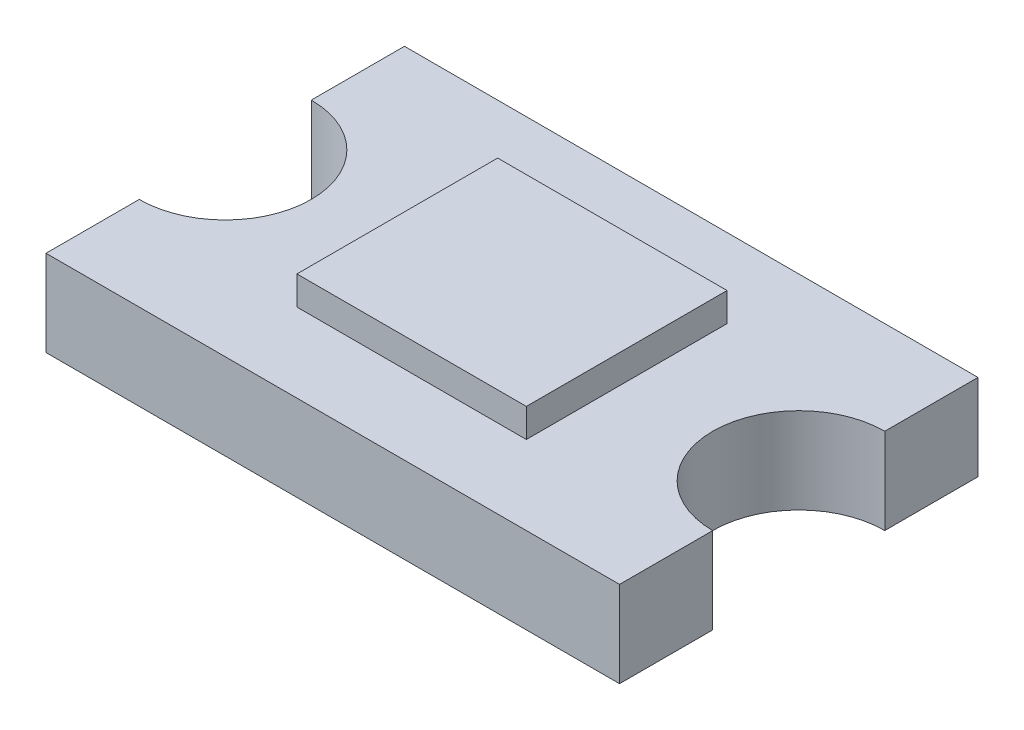
ISO-10303-21;
HEADER;
FILE_DESCRIPTION(('STEP AP214'),'2;1');
FILE_NAME('part.step','',(''),(''),'','','');
FILE_SCHEMA(('AUTOMOTIVE_DESIGN { 1 0 10303 214 1 1 1 1 }'));
ENDSEC;
DATA;
#1=APPLICATION_CONTEXT('core data for automotive mechanical design processes');
#2=APPLICATION_PROTOCOL_DEFINITION('international standard','automotive_design',2000,#1);
#3=PRODUCT_CONTEXT('',#1,'mechanical');
#4=PRODUCT('Part','Part','',(#3));
#5=PRODUCT_RELATED_PRODUCT_CATEGORY('part','',(#4));
#6=PRODUCT_DEFINITION_FORMATION('','',#4);
#7=PRODUCT_DEFINITION_CONTEXT('part definition',#1,'design');
#8=PRODUCT_DEFINITION('design','',#6,#7);
#9=PRODUCT_DEFINITION_SHAPE('','',#8);
#10=(LENGTH_UNIT() NAMED_UNIT(*) SI_UNIT(.MILLI.,.METRE.));
#11=(NAMED_UNIT(*) PLANE_ANGLE_UNIT() SI_UNIT($,.RADIAN.));
#12=(NAMED_UNIT(*) SI_UNIT($,.STERADIAN.) SOLID_ANGLE_UNIT());
#13=UNCERTAINTY_MEASURE_WITH_UNIT(LENGTH_MEASURE(1.E-05),#10,'distance_accuracy_value','');
#14=(GEOMETRIC_REPRESENTATION_CONTEXT(3) GLOBAL_UNCERTAINTY_ASSIGNED_CONTEXT((#13)) GLOBAL_UNIT_ASSIGNED_CONTEXT((#10,
#11,#12)) REPRESENTATION_CONTEXT('',''));
#15=CARTESIAN_POINT('',(0.,0.,0.));
#16=DIRECTION('',(0.,0.,1.));
#17=DIRECTION('',(1.,0.,0.));
#18=AXIS2_PLACEMENT_3D('',#15,#16,#17);
#19=CARTESIAN_POINT('',(1.,0.3,0.));
#20=DIRECTION('',(0.,-1.,0.));
#21=DIRECTION('',(0.,0.,-1.));
#22=AXIS2_PLACEMENT_3D('',#19,#20,#21);
#23=CYLINDRICAL_SURFACE('',#22,0.3);
#24=CARTESIAN_POINT('',(1.,0.,0.));
#25=DIRECTION('',(0.,-1.,0.));
#26=DIRECTION('',(0.,0.,1.));
#27=AXIS2_PLACEMENT_3D('',#24,#25,#26);
#28=CIRCLE('',#27,0.3);
#29=CARTESIAN_POINT('',(1.,0.,0.3));
#30=VERTEX_POINT('',#29);
#31=CARTESIAN_POINT('',(1.,0.,-0.3));
#32=VERTEX_POINT('',#31);
#33=EDGE_CURVE('P0_E150',#30,#32,#28,.T.);
#34=ORIENTED_EDGE('',*,*,#33,.T.);
#35=DIRECTION('',(0.,-1.,0.));
#36=VECTOR('',#35,1.);
#37=CARTESIAN_POINT('',(1.,0.3,-0.3));
#38=LINE('',#37,#36);
#39=CARTESIAN_POINT('',(1.,0.3,-0.3));
#40=VERTEX_POINT('',#39);
#41=EDGE_CURVE('P0_E146',#40,#32,#38,.T.);
#42=ORIENTED_EDGE('',*,*,#41,.F.);
#43=CARTESIAN_POINT('',(1.,0.3,0.));
#44=DIRECTION('',(0.,-1.,0.));
#45=DIRECTION('',(0.,0.,1.));
#46=AXIS2_PLACEMENT_3D('',#43,#44,#45);
#47=CIRCLE('',#46,0.3);
#48=CARTESIAN_POINT('',(1.,0.3,0.3));
#49=VERTEX_POINT('',#48);
#50=EDGE_CURVE('P0_E11',#49,#40,#47,.T.);
#51=ORIENTED_EDGE('',*,*,#50,.F.);
#52=DIRECTION('',(0.,-1.,0.));
#53=VECTOR('',#52,1.);
#54=CARTESIAN_POINT('',(1.,0.3,0.3));
#55=LINE('',#54,#53);
#56=EDGE_CURVE('P0_E25',#49,#30,#55,.T.);
#57=ORIENTED_EDGE('',*,*,#56,.T.);
#58=EDGE_LOOP('',(#34,#42,#51,#57));
#59=FACE_BOUND('',#58,.T.);
#60=ADVANCED_FACE('P0_F17',(#59),#23,.F.);
#61=CARTESIAN_POINT('',(-1.,0.3,0.625));
#62=DIRECTION('',(0.,0.,-1.));
#63=DIRECTION('',(0.,-1.,0.));
#64=AXIS2_PLACEMENT_3D('',#61,#62,#63);
#65=PLANE('',#64);
#66=DIRECTION('',(1.,0.,0.));
#67=VECTOR('',#66,1.);
#68=CARTESIAN_POINT('',(-1.,0.,0.625));
#69=LINE('',#68,#67);
#70=CARTESIAN_POINT('',(-1.,0.,0.625));
#71=VERTEX_POINT('',#70);
#72=CARTESIAN_POINT('',(1.,0.,0.625));
#73=VERTEX_POINT('',#72);
#74=EDGE_CURVE('P0_E174',#71,#73,#69,.T.);
#75=ORIENTED_EDGE('',*,*,#74,.T.);
#76=DIRECTION('',(0.,-1.,0.));
#77=VECTOR('',#76,1.);
#78=CARTESIAN_POINT('',(1.,0.3,0.625));
#79=LINE('',#78,#77);
#80=CARTESIAN_POINT('',(1.,0.3,0.625));
#81=VERTEX_POINT('',#80);
#82=EDGE_CURVE('P0_E142',#81,#73,#79,.T.);
#83=ORIENTED_EDGE('',*,*,#82,.F.);
#84=DIRECTION('',(1.,0.,0.));
#85=VECTOR('',#84,1.);
#86=CARTESIAN_POINT('',(-1.,0.3,0.625));
#87=LINE('',#86,#85);
#88=CARTESIAN_POINT('',(-1.,0.3,0.625));
#89=VERTEX_POINT('',#88);
#90=EDGE_CURVE('P0_E165',#89,#81,#87,.T.);
#91=ORIENTED_EDGE('',*,*,#90,.F.);
#92=DIRECTION('',(0.,-1.,0.));
#93=VECTOR('',#92,1.);
#94=CARTESIAN_POINT('',(-1.,0.3,0.625));
#95=LINE('',#94,#93);
#96=EDGE_CURVE('P0_E138',#89,#71,#95,.T.);
#97=ORIENTED_EDGE('',*,*,#96,.T.);
#98=EDGE_LOOP('',(#75,#83,#91,#97));
#99=FACE_BOUND('',#98,.T.);
#100=ADVANCED_FACE('P0_F388',(#99),#65,.F.);
#101=CARTESIAN_POINT('',(-1.,0.3,0.));
#102=DIRECTION('',(0.,-1.,0.));
#103=DIRECTION('',(0.,0.,-1.));
#104=AXIS2_PLACEMENT_3D('',#101,#102,#103);
#105=CYLINDRICAL_SURFACE('',#104,0.3);
#106=CARTESIAN_POINT('',(-1.,0.,0.));
#107=DIRECTION('',(0.,-1.,0.));
#108=DIRECTION('',(0.,0.,1.));
#109=AXIS2_PLACEMENT_3D('',#106,#107,#108);
#110=CIRCLE('',#109,0.3);
#111=CARTESIAN_POINT('',(-1.,0.,-0.3));
#112=VERTEX_POINT('',#111);
#113=CARTESIAN_POINT('',(-1.,0.,0.3));
#114=VERTEX_POINT('',#113);
#115=EDGE_CURVE('P0_E101',#112,#114,#110,.T.);
#116=ORIENTED_EDGE('',*,*,#115,.T.);
#117=DIRECTION('',(0.,-1.,0.));
#118=VECTOR('',#117,1.);
#119=CARTESIAN_POINT('',(-1.,0.3,0.3));
#120=LINE('',#119,#118);
#121=CARTESIAN_POINT('',(-1.,0.3,0.3));
#122=VERTEX_POINT('',#121);
#123=EDGE_CURVE('P0_E111',#122,#114,#120,.T.);
#124=ORIENTED_EDGE('',*,*,#123,.F.);
#125=CARTESIAN_POINT('',(-1.,0.3,0.));
#126=DIRECTION('',(0.,-1.,0.));
#127=DIRECTION('',(0.,0.,1.));
#128=AXIS2_PLACEMENT_3D('',#125,#126,#127);
#129=CIRCLE('',#128,0.3);
#130=CARTESIAN_POINT('',(-1.,0.3,-0.3));
#131=VERTEX_POINT('',#130);
#132=EDGE_CURVE('P0_E118',#131,#122,#129,.T.);
#133=ORIENTED_EDGE('',*,*,#132,.F.);
#134=DIRECTION('',(0.,-1.,0.));
#135=VECTOR('',#134,1.);
#136=CARTESIAN_POINT('',(-1.,0.3,-0.3));
#137=LINE('',#136,#135);
#138=EDGE_CURVE('P0_E115',#131,#112,#137,.T.);
#139=ORIENTED_EDGE('',*,*,#138,.T.);
#140=EDGE_LOOP('',(#116,#124,#133,#139));
#141=FACE_BOUND('',#140,.T.);
#142=ADVANCED_FACE('P0_F116',(#141),#105,.F.);
#143=CARTESIAN_POINT('',(-1.,0.3,-0.625));
#144=DIRECTION('',(0.,0.,1.));
#145=DIRECTION('',(1.,0.,0.));
#146=AXIS2_PLACEMENT_3D('',#143,#144,#145);
#147=PLANE('',#146);
#148=DIRECTION('',(-1.,0.,0.));
#149=VECTOR('',#148,1.);
#150=CARTESIAN_POINT('',(-1.,0.,-0.625));
#151=LINE('',#150,#149);
#152=CARTESIAN_POINT('',(1.,0.,-0.625));
#153=VERTEX_POINT('',#152);
#154=CARTESIAN_POINT('',(-1.,0.,-0.625));
#155=VERTEX_POINT('',#154);
#156=EDGE_CURVE('P0_E153',#153,#155,#151,.T.);
#157=ORIENTED_EDGE('',*,*,#156,.T.);
#158=DIRECTION('',(0.,-1.,0.));
#159=VECTOR('',#158,1.);
#160=CARTESIAN_POINT('',(-1.,0.3,-0.625));
#161=LINE('',#160,#159);
#162=CARTESIAN_POINT('',(-1.,0.3,-0.625));
#163=VERTEX_POINT('',#162);
#164=EDGE_CURVE('P0_E126',#163,#155,#161,.T.);
#165=ORIENTED_EDGE('',*,*,#164,.F.);
#166=DIRECTION('',(-1.,0.,0.));
#167=VECTOR('',#166,1.);
#168=CARTESIAN_POINT('',(-1.,0.3,-0.625));
#169=LINE('',#168,#167);
#170=CARTESIAN_POINT('',(1.,0.3,-0.625));
#171=VERTEX_POINT('',#170);
#172=EDGE_CURVE('P0_E168',#171,#163,#169,.T.);
#173=ORIENTED_EDGE('',*,*,#172,.F.);
#174=DIRECTION('',(0.,-1.,0.));
#175=VECTOR('',#174,1.);
#176=CARTESIAN_POINT('',(1.,0.3,-0.625));
#177=LINE('',#176,#175);
#178=EDGE_CURVE('P0_E112',#171,#153,#177,.T.);
#179=ORIENTED_EDGE('',*,*,#178,.T.);
#180=EDGE_LOOP('',(#157,#165,#173,#179));
#181=FACE_BOUND('',#180,.T.);
#182=ADVANCED_FACE('P0_F212',(#181),#147,.F.);
#183=CARTESIAN_POINT('',(1.,0.,0.));
#184=DIRECTION('',(0.,1.,0.));
#185=DIRECTION('',(1.,0.,0.));
#186=AXIS2_PLACEMENT_3D('',#183,#184,#185);
#187=PLANE('',#186);
#188=ORIENTED_EDGE('',*,*,#74,.F.);
#189=DIRECTION('',(0.,0.,1.));
#190=VECTOR('',#189,1.);
#191=CARTESIAN_POINT('',(-1.,0.,0.625));
#192=LINE('',#191,#190);
#193=EDGE_CURVE('P0_E46',#114,#71,#192,.T.);
#194=ORIENTED_EDGE('',*,*,#193,.F.);
#195=ORIENTED_EDGE('',*,*,#115,.F.);
#196=DIRECTION('',(0.,0.,1.));
#197=VECTOR('',#196,1.);
#198=CARTESIAN_POINT('',(-1.,0.,-0.3));
#199=LINE('',#198,#197);
#200=EDGE_CURVE('P0_E106',#155,#112,#199,.T.);
#201=ORIENTED_EDGE('',*,*,#200,.F.);
#202=ORIENTED_EDGE('',*,*,#156,.F.);
#203=DIRECTION('',(0.,0.,-1.));
#204=VECTOR('',#203,1.);
#205=CARTESIAN_POINT('',(1.,0.,-0.3));
#206=LINE('',#205,#204);
#207=EDGE_CURVE('P0_E147',#32,#153,#206,.T.);
#208=ORIENTED_EDGE('',*,*,#207,.F.);
#209=ORIENTED_EDGE('',*,*,#33,.F.);
#210=DIRECTION('',(0.,0.,-1.));
#211=VECTOR('',#210,1.);
#212=CARTESIAN_POINT('',(1.,0.,0.625));
#213=LINE('',#212,#211);
#214=EDGE_CURVE('P0_E162',#73,#30,#213,.T.);
#215=ORIENTED_EDGE('',*,*,#214,.F.);
#216=EDGE_LOOP('',(#188,#194,#195,#201,#202,#208,#209,#215));
#217=FACE_BOUND('',#216,.T.);
#218=ADVANCED_FACE('P0_F103',(#217),#187,.F.);
#219=CARTESIAN_POINT('',(1.,0.3,0.));
#220=DIRECTION('',(0.,1.,0.));
#221=DIRECTION('',(1.,0.,0.));
#222=AXIS2_PLACEMENT_3D('',#219,#220,#221);
#223=PLANE('',#222);
#224=ORIENTED_EDGE('',*,*,#90,.T.);
#225=DIRECTION('',(0.,0.,-1.));
#226=VECTOR('',#225,1.);
#227=CARTESIAN_POINT('',(1.,0.3,0.625));
#228=LINE('',#227,#226);
#229=EDGE_CURVE('P0_E36',#81,#49,#228,.T.);
#230=ORIENTED_EDGE('',*,*,#229,.T.);
#231=ORIENTED_EDGE('',*,*,#50,.T.);
#232=DIRECTION('',(0.,0.,-1.));
#233=VECTOR('',#232,1.);
#234=CARTESIAN_POINT('',(1.,0.3,-0.3));
#235=LINE('',#234,#233);
#236=EDGE_CURVE('P0_E143',#40,#171,#235,.T.);
#237=ORIENTED_EDGE('',*,*,#236,.T.);
#238=ORIENTED_EDGE('',*,*,#172,.T.);
#239=DIRECTION('',(0.,0.,1.));
#240=VECTOR('',#239,1.);
#241=CARTESIAN_POINT('',(-1.,0.3,-0.3));
#242=LINE('',#241,#240);
#243=EDGE_CURVE('P0_E122',#163,#131,#242,.T.);
#244=ORIENTED_EDGE('',*,*,#243,.T.);
#245=ORIENTED_EDGE('',*,*,#132,.T.);
#246=DIRECTION('',(0.,0.,1.));
#247=VECTOR('',#246,1.);
#248=CARTESIAN_POINT('',(-1.,0.3,0.625));
#249=LINE('',#248,#247);
#250=EDGE_CURVE('P0_E135',#122,#89,#249,.T.);
#251=ORIENTED_EDGE('',*,*,#250,.T.);
#252=EDGE_LOOP('',(#224,#230,#231,#237,#238,#244,#245,#251));
#253=FACE_BOUND('',#252,.T.);
#254=ADVANCED_FACE('P0_F209',(#253),#223,.T.);
#255=CARTESIAN_POINT('',(1.,0.3,0.625));
#256=DIRECTION('',(-1.,0.,0.));
#257=DIRECTION('',(0.,0.,1.));
#258=AXIS2_PLACEMENT_3D('',#255,#256,#257);
#259=PLANE('',#258);
#260=ORIENTED_EDGE('',*,*,#214,.T.);
#261=ORIENTED_EDGE('',*,*,#56,.F.);
#262=ORIENTED_EDGE('',*,*,#229,.F.);
#263=ORIENTED_EDGE('',*,*,#82,.T.);
#264=EDGE_LOOP('',(#260,#261,#262,#263));
#265=FACE_BOUND('',#264,.T.);
#266=ADVANCED_FACE('P0_F331',(#265),#259,.F.);
#267=CARTESIAN_POINT('',(-1.,0.3,0.625));
#268=DIRECTION('',(1.,0.,0.));
#269=DIRECTION('',(0.,1.,0.));
#270=AXIS2_PLACEMENT_3D('',#267,#268,#269);
#271=PLANE('',#270);
#272=ORIENTED_EDGE('',*,*,#250,.F.);
#273=ORIENTED_EDGE('',*,*,#123,.T.);
#274=ORIENTED_EDGE('',*,*,#193,.T.);
#275=ORIENTED_EDGE('',*,*,#96,.F.);
#276=EDGE_LOOP('',(#272,#273,#274,#275));
#277=FACE_BOUND('',#276,.T.);
#278=ADVANCED_FACE('P0_F320',(#277),#271,.F.);
#279=CARTESIAN_POINT('',(1.,0.3,-0.3));
#280=DIRECTION('',(-1.,0.,0.));
#281=DIRECTION('',(0.,0.,1.));
#282=AXIS2_PLACEMENT_3D('',#279,#280,#281);
#283=PLANE('',#282);
#284=ORIENTED_EDGE('',*,*,#207,.T.);
#285=ORIENTED_EDGE('',*,*,#178,.F.);
#286=ORIENTED_EDGE('',*,*,#236,.F.);
#287=ORIENTED_EDGE('',*,*,#41,.T.);
#288=EDGE_LOOP('',(#284,#285,#286,#287));
#289=FACE_BOUND('',#288,.T.);
#290=ADVANCED_FACE('P0_F199',(#289),#283,.F.);
#291=CARTESIAN_POINT('',(-1.,0.3,-0.3));
#292=DIRECTION('',(1.,0.,0.));
#293=DIRECTION('',(0.,1.,0.));
#294=AXIS2_PLACEMENT_3D('',#291,#292,#293);
#295=PLANE('',#294);
#296=ORIENTED_EDGE('',*,*,#243,.F.);
#297=ORIENTED_EDGE('',*,*,#164,.T.);
#298=ORIENTED_EDGE('',*,*,#200,.T.);
#299=ORIENTED_EDGE('',*,*,#138,.F.);
#300=EDGE_LOOP('',(#296,#297,#298,#299));
#301=FACE_BOUND('',#300,.T.);
#302=ADVANCED_FACE('P0_F124',(#301),#295,.F.);
#303=CLOSED_SHELL('',(#60,#100,#142,#182,#218,#254,#266,#278,#290,#302));
#304=MANIFOLD_SOLID_BREP('P0_B1',#303);
#305=CARTESIAN_POINT('',(0.,0.3,0.));
#306=DIRECTION('',(0.,-1.,0.));
#307=DIRECTION('',(0.,0.,-1.));
#308=AXIS2_PLACEMENT_3D('',#305,#306,#307);
#309=PLANE('',#308);
#310=DIRECTION('',(0.,0.,-1.));
#311=VECTOR('',#310,1.);
#312=CARTESIAN_POINT('',(0.4,0.3,0.35));
#313=LINE('',#312,#311);
#314=CARTESIAN_POINT('',(0.4,0.3,0.35));
#315=VERTEX_POINT('',#314);
#316=CARTESIAN_POINT('',(0.4,0.3,-0.35));
#317=VERTEX_POINT('',#316);
#318=EDGE_CURVE('P1_E80',#315,#317,#313,.T.);
#319=ORIENTED_EDGE('',*,*,#318,.F.);
#320=DIRECTION('',(1.,0.,0.));
#321=VECTOR('',#320,1.);
#322=CARTESIAN_POINT('',(-0.4,0.3,0.35));
#323=LINE('',#322,#321);
#324=CARTESIAN_POINT('',(-0.4,0.3,0.35));
#325=VERTEX_POINT('',#324);
#326=EDGE_CURVE('P1_E20',#325,#315,#323,.T.);
#327=ORIENTED_EDGE('',*,*,#326,.F.);
#328=DIRECTION('',(0.,0.,1.));
#329=VECTOR('',#328,1.);
#330=CARTESIAN_POINT('',(-0.4,0.3,0.35));
#331=LINE('',#330,#329);
#332=CARTESIAN_POINT('',(-0.4,0.3,-0.35));
#333=VERTEX_POINT('',#332);
#334=EDGE_CURVE('P1_E100',#333,#325,#331,.T.);
#335=ORIENTED_EDGE('',*,*,#334,.F.);
#336=DIRECTION('',(-1.,0.,0.));
#337=VECTOR('',#336,1.);
#338=CARTESIAN_POINT('',(-0.4,0.3,-0.35));
#339=LINE('',#338,#337);
#340=EDGE_CURVE('P1_E84',#317,#333,#339,.T.);
#341=ORIENTED_EDGE('',*,*,#340,.F.);
#342=EDGE_LOOP('',(#319,#327,#335,#341));
#343=FACE_BOUND('',#342,.T.);
#344=ADVANCED_FACE('P1_F17',(#343),#309,.T.);
#345=CARTESIAN_POINT('',(0.,0.4,0.));
#346=DIRECTION('',(0.,-1.,0.));
#347=DIRECTION('',(0.,0.,-1.));
#348=AXIS2_PLACEMENT_3D('',#345,#346,#347);
#349=PLANE('',#348);
#350=DIRECTION('',(0.,0.,-1.));
#351=VECTOR('',#350,1.);
#352=CARTESIAN_POINT('',(0.4,0.4,0.35));
#353=LINE('',#352,#351);
#354=CARTESIAN_POINT('',(0.4,0.4,0.35));
#355=VERTEX_POINT('',#354);
#356=CARTESIAN_POINT('',(0.4,0.4,-0.35));
#357=VERTEX_POINT('',#356);
#358=EDGE_CURVE('P1_E82',#355,#357,#353,.T.);
#359=ORIENTED_EDGE('',*,*,#358,.T.);
#360=DIRECTION('',(-1.,0.,0.));
#361=VECTOR('',#360,1.);
#362=CARTESIAN_POINT('',(-0.4,0.4,-0.35));
#363=LINE('',#362,#361);
#364=CARTESIAN_POINT('',(-0.4,0.4,-0.35));
#365=VERTEX_POINT('',#364);
#366=EDGE_CURVE('P1_E97',#357,#365,#363,.T.);
#367=ORIENTED_EDGE('',*,*,#366,.T.);
#368=DIRECTION('',(0.,0.,1.));
#369=VECTOR('',#368,1.);
#370=CARTESIAN_POINT('',(-0.4,0.4,0.35));
#371=LINE('',#370,#369);
#372=CARTESIAN_POINT('',(-0.4,0.4,0.35));
#373=VERTEX_POINT('',#372);
#374=EDGE_CURVE('P1_E75',#365,#373,#371,.T.);
#375=ORIENTED_EDGE('',*,*,#374,.T.);
#376=DIRECTION('',(1.,0.,0.));
#377=VECTOR('',#376,1.);
#378=CARTESIAN_POINT('',(-0.4,0.4,0.35));
#379=LINE('',#378,#377);
#380=EDGE_CURVE('P1_E11',#373,#355,#379,.T.);
#381=ORIENTED_EDGE('',*,*,#380,.T.);
#382=EDGE_LOOP('',(#359,#367,#375,#381));
#383=FACE_BOUND('',#382,.T.);
#384=ADVANCED_FACE('P1_F117',(#383),#349,.F.);
#385=CARTESIAN_POINT('',(-0.4,0.4,0.35));
#386=DIRECTION('',(0.,0.,-1.));
#387=DIRECTION('',(0.,-1.,0.));
#388=AXIS2_PLACEMENT_3D('',#385,#386,#387);
#389=PLANE('',#388);
#390=ORIENTED_EDGE('',*,*,#326,.T.);
#391=DIRECTION('',(0.,-1.,0.));
#392=VECTOR('',#391,1.);
#393=CARTESIAN_POINT('',(0.4,0.4,0.35));
#394=LINE('',#393,#392);
#395=EDGE_CURVE('P1_E69',#355,#315,#394,.T.);
#396=ORIENTED_EDGE('',*,*,#395,.F.);
#397=ORIENTED_EDGE('',*,*,#380,.F.);
#398=DIRECTION('',(0.,-1.,0.));
#399=VECTOR('',#398,1.);
#400=CARTESIAN_POINT('',(-0.4,0.4,0.35));
#401=LINE('',#400,#399);
#402=EDGE_CURVE('P1_E72',#373,#325,#401,.T.);
#403=ORIENTED_EDGE('',*,*,#402,.T.);
#404=EDGE_LOOP('',(#390,#396,#397,#403));
#405=FACE_BOUND('',#404,.T.);
#406=ADVANCED_FACE('P1_F68',(#405),#389,.F.);
#407=CARTESIAN_POINT('',(-0.4,0.4,0.35));
#408=DIRECTION('',(1.,0.,0.));
#409=DIRECTION('',(0.,1.,0.));
#410=AXIS2_PLACEMENT_3D('',#407,#408,#409);
#411=PLANE('',#410);
#412=ORIENTED_EDGE('',*,*,#334,.T.);
#413=ORIENTED_EDGE('',*,*,#402,.F.);
#414=ORIENTED_EDGE('',*,*,#374,.F.);
#415=DIRECTION('',(0.,-1.,0.));
#416=VECTOR('',#415,1.);
#417=CARTESIAN_POINT('',(-0.4,0.4,-0.35));
#418=LINE('',#417,#416);
#419=EDGE_CURVE('P1_E101',#365,#333,#418,.T.);
#420=ORIENTED_EDGE('',*,*,#419,.T.);
#421=EDGE_LOOP('',(#412,#413,#414,#420));
#422=FACE_BOUND('',#421,.T.);
#423=ADVANCED_FACE('P1_F120',(#422),#411,.F.);
#424=CARTESIAN_POINT('',(-0.4,0.4,-0.35));
#425=DIRECTION('',(0.,0.,1.));
#426=DIRECTION('',(1.,0.,0.));
#427=AXIS2_PLACEMENT_3D('',#424,#425,#426);
#428=PLANE('',#427);
#429=ORIENTED_EDGE('',*,*,#340,.T.);
#430=ORIENTED_EDGE('',*,*,#419,.F.);
#431=ORIENTED_EDGE('',*,*,#366,.F.);
#432=DIRECTION('',(0.,-1.,0.));
#433=VECTOR('',#432,1.);
#434=CARTESIAN_POINT('',(0.4,0.4,-0.35));
#435=LINE('',#434,#433);
#436=EDGE_CURVE('P1_E89',#357,#317,#435,.T.);
#437=ORIENTED_EDGE('',*,*,#436,.T.);
#438=EDGE_LOOP('',(#429,#430,#431,#437));
#439=FACE_BOUND('',#438,.T.);
#440=ADVANCED_FACE('P1_F122',(#439),#428,.F.);
#441=CARTESIAN_POINT('',(0.4,0.4,0.35));
#442=DIRECTION('',(-1.,0.,0.));
#443=DIRECTION('',(0.,0.,1.));
#444=AXIS2_PLACEMENT_3D('',#441,#442,#443);
#445=PLANE('',#444);
#446=ORIENTED_EDGE('',*,*,#318,.T.);
#447=ORIENTED_EDGE('',*,*,#436,.F.);
#448=ORIENTED_EDGE('',*,*,#358,.F.);
#449=ORIENTED_EDGE('',*,*,#395,.T.);
#450=EDGE_LOOP('',(#446,#447,#448,#449));
#451=FACE_BOUND('',#450,.T.);
#452=ADVANCED_FACE('P1_F78',(#451),#445,.F.);
#453=CLOSED_SHELL('',(#344,#384,#406,#423,#440,#452));
#454=MANIFOLD_SOLID_BREP('P1_B1',#453);
#455=ADVANCED_BREP_SHAPE_REPRESENTATION('',(#18,#304,#454),#14);
#456=SHAPE_DEFINITION_REPRESENTATION(#9,#455);
ENDSEC;
END-ISO-10303-21;
